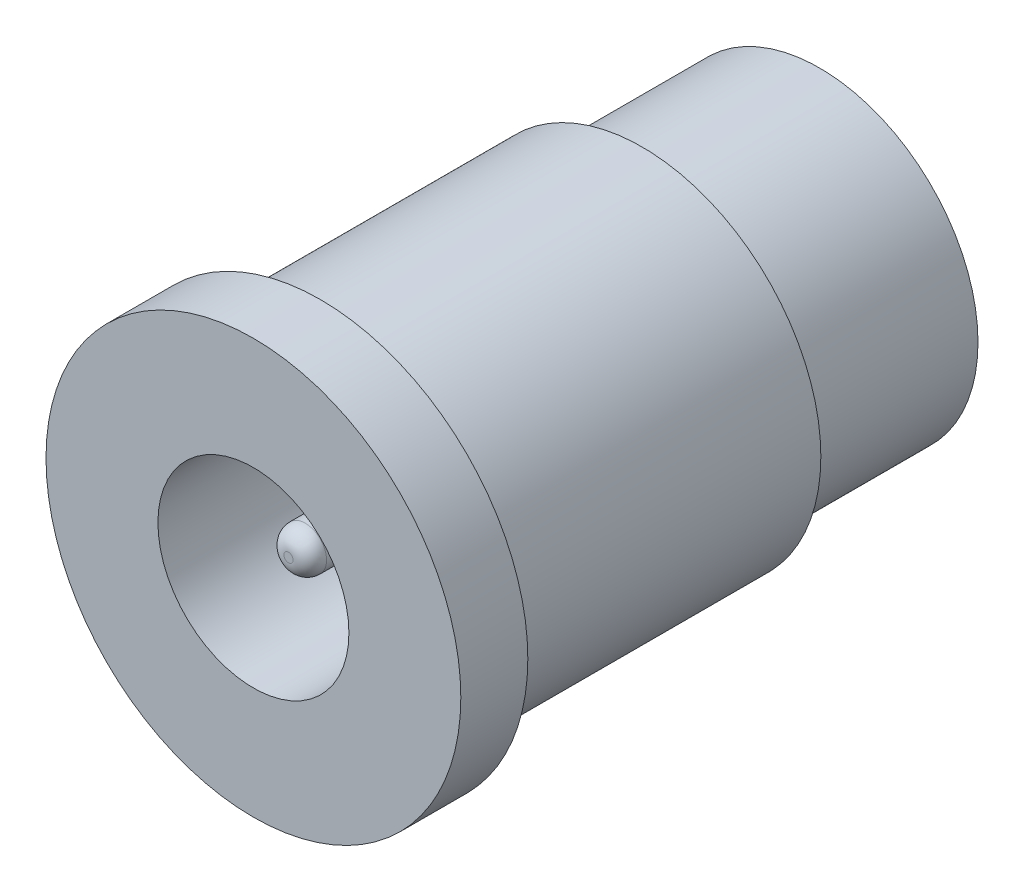
ISO-10303-21;
HEADER;
FILE_DESCRIPTION(('STEP AP214'),'2;1');
FILE_NAME('part.step','',(''),(''),'','','');
FILE_SCHEMA(('AUTOMOTIVE_DESIGN { 1 0 10303 214 1 1 1 1 }'));
ENDSEC;
DATA;
#1=APPLICATION_CONTEXT('core data for automotive mechanical design processes');
#2=APPLICATION_PROTOCOL_DEFINITION('international standard','automotive_design',2000,#1);
#3=PRODUCT_CONTEXT('',#1,'mechanical');
#4=PRODUCT('Part','Part','',(#3));
#5=PRODUCT_RELATED_PRODUCT_CATEGORY('part','',(#4));
#6=PRODUCT_DEFINITION_FORMATION('','',#4);
#7=PRODUCT_DEFINITION_CONTEXT('part definition',#1,'design');
#8=PRODUCT_DEFINITION('design','',#6,#7);
#9=PRODUCT_DEFINITION_SHAPE('','',#8);
#10=(LENGTH_UNIT() NAMED_UNIT(*) SI_UNIT(.MILLI.,.METRE.));
#11=(NAMED_UNIT(*) PLANE_ANGLE_UNIT() SI_UNIT($,.RADIAN.));
#12=(NAMED_UNIT(*) SI_UNIT($,.STERADIAN.) SOLID_ANGLE_UNIT());
#13=UNCERTAINTY_MEASURE_WITH_UNIT(LENGTH_MEASURE(1.E-05),#10,'distance_accuracy_value','');
#14=(GEOMETRIC_REPRESENTATION_CONTEXT(3) GLOBAL_UNCERTAINTY_ASSIGNED_CONTEXT((#13)) GLOBAL_UNIT_ASSIGNED_CONTEXT((#10,
#11,#12)) REPRESENTATION_CONTEXT('',''));
#15=CARTESIAN_POINT('',(0.,0.,0.));
#16=DIRECTION('',(0.,0.,1.));
#17=DIRECTION('',(1.,0.,0.));
#18=AXIS2_PLACEMENT_3D('',#15,#16,#17);
#19=CARTESIAN_POINT('',(0.,0.,5.00661764705883));
#20=DIRECTION('',(0.,0.,1.));
#21=DIRECTION('',(1.,0.,0.));
#22=AXIS2_PLACEMENT_3D('',#19,#20,#21);
#23=CYLINDRICAL_SURFACE('',#22,2.85);
#24=CARTESIAN_POINT('',(0.,0.,-11.6));
#25=DIRECTION('',(0.,0.,1.));
#26=DIRECTION('',(1.,0.,0.));
#27=AXIS2_PLACEMENT_3D('',#24,#25,#26);
#28=CIRCLE('',#27,2.85);
#29=CARTESIAN_POINT('',(2.85,0.,-11.6));
#30=VERTEX_POINT('',#29);
#31=EDGE_CURVE('E67',#30,#30,#28,.T.);
#32=ORIENTED_EDGE('',*,*,#31,.F.);
#33=EDGE_LOOP('',(#32));
#34=FACE_BOUND('',#33,.T.);
#35=CARTESIAN_POINT('',(0.,0.,0.));
#36=DIRECTION('',(0.,0.,1.));
#37=DIRECTION('',(1.,0.,0.));
#38=AXIS2_PLACEMENT_3D('',#35,#36,#37);
#39=CIRCLE('',#38,2.85);
#40=CARTESIAN_POINT('',(2.85,0.,0.));
#41=VERTEX_POINT('',#40);
#42=EDGE_CURVE('E10',#41,#41,#39,.T.);
#43=ORIENTED_EDGE('',*,*,#42,.T.);
#44=EDGE_LOOP('',(#43));
#45=FACE_BOUND('',#44,.T.);
#46=ADVANCED_FACE('F30',(#34,#45),#23,.F.);
#47=CARTESIAN_POINT('',(0.,2.85,0.));
#48=DIRECTION('',(0.,0.,-1.));
#49=DIRECTION('',(-1.,0.,0.));
#50=AXIS2_PLACEMENT_3D('',#47,#48,#49);
#51=PLANE('',#50);
#52=ORIENTED_EDGE('',*,*,#42,.F.);
#53=EDGE_LOOP('',(#52));
#54=FACE_BOUND('',#53,.T.);
#55=CARTESIAN_POINT('',(0.,0.,0.));
#56=DIRECTION('',(0.,0.,1.));
#57=DIRECTION('',(1.,0.,0.));
#58=AXIS2_PLACEMENT_3D('',#55,#56,#57);
#59=CIRCLE('',#58,6.19);
#60=CARTESIAN_POINT('',(6.19,0.,0.));
#61=VERTEX_POINT('',#60);
#62=EDGE_CURVE('E36',#61,#61,#59,.T.);
#63=ORIENTED_EDGE('',*,*,#62,.T.);
#64=EDGE_LOOP('',(#63));
#65=FACE_BOUND('',#64,.T.);
#66=ADVANCED_FACE('F74',(#54,#65),#51,.F.);
#67=CARTESIAN_POINT('',(0.,0.,5.00661764705883));
#68=DIRECTION('',(0.,0.,1.));
#69=DIRECTION('',(1.,0.,0.));
#70=AXIS2_PLACEMENT_3D('',#67,#68,#69);
#71=CYLINDRICAL_SURFACE('',#70,6.19);
#72=ORIENTED_EDGE('',*,*,#62,.F.);
#73=EDGE_LOOP('',(#72));
#74=FACE_BOUND('',#73,.T.);
#75=CARTESIAN_POINT('',(0.,0.,-2.));
#76=DIRECTION('',(0.,0.,1.));
#77=DIRECTION('',(1.,0.,0.));
#78=AXIS2_PLACEMENT_3D('',#75,#76,#77);
#79=CIRCLE('',#78,6.19);
#80=CARTESIAN_POINT('',(6.19,0.,-2.));
#81=VERTEX_POINT('',#80);
#82=EDGE_CURVE('E40',#81,#81,#79,.T.);
#83=ORIENTED_EDGE('',*,*,#82,.T.);
#84=EDGE_LOOP('',(#83));
#85=FACE_BOUND('',#84,.T.);
#86=ADVANCED_FACE('F78',(#74,#85),#71,.T.);
#87=CARTESIAN_POINT('',(0.,6.19,-2.));
#88=DIRECTION('',(0.,0.,1.));
#89=DIRECTION('',(1.,0.,0.));
#90=AXIS2_PLACEMENT_3D('',#87,#88,#89);
#91=PLANE('',#90);
#92=ORIENTED_EDGE('',*,*,#82,.F.);
#93=EDGE_LOOP('',(#92));
#94=FACE_BOUND('',#93,.T.);
#95=CARTESIAN_POINT('',(0.,0.,-2.));
#96=DIRECTION('',(0.,0.,1.));
#97=DIRECTION('',(1.,0.,0.));
#98=AXIS2_PLACEMENT_3D('',#95,#96,#97);
#99=CIRCLE('',#98,5.335);
#100=CARTESIAN_POINT('',(5.335,0.,-2.));
#101=VERTEX_POINT('',#100);
#102=EDGE_CURVE('E44',#101,#101,#99,.T.);
#103=ORIENTED_EDGE('',*,*,#102,.T.);
#104=EDGE_LOOP('',(#103));
#105=FACE_BOUND('',#104,.T.);
#106=ADVANCED_FACE('F83',(#94,#105),#91,.F.);
#107=CARTESIAN_POINT('',(0.,0.,5.00661764705883));
#108=DIRECTION('',(0.,0.,1.));
#109=DIRECTION('',(1.,0.,0.));
#110=AXIS2_PLACEMENT_3D('',#107,#108,#109);
#111=CYLINDRICAL_SURFACE('',#110,5.335);
#112=ORIENTED_EDGE('',*,*,#102,.F.);
#113=EDGE_LOOP('',(#112));
#114=FACE_BOUND('',#113,.T.);
#115=CARTESIAN_POINT('',(0.,0.,-11.6));
#116=DIRECTION('',(0.,0.,1.));
#117=DIRECTION('',(1.,0.,0.));
#118=AXIS2_PLACEMENT_3D('',#115,#116,#117);
#119=CIRCLE('',#118,5.335);
#120=CARTESIAN_POINT('',(5.335,0.,-11.6));
#121=VERTEX_POINT('',#120);
#122=EDGE_CURVE('E49',#121,#121,#119,.T.);
#123=ORIENTED_EDGE('',*,*,#122,.T.);
#124=EDGE_LOOP('',(#123));
#125=FACE_BOUND('',#124,.T.);
#126=ADVANCED_FACE('F89',(#114,#125),#111,.T.);
#127=CARTESIAN_POINT('',(0.,5.335,-11.6));
#128=DIRECTION('',(0.,0.,1.));
#129=DIRECTION('',(1.,0.,0.));
#130=AXIS2_PLACEMENT_3D('',#127,#128,#129);
#131=PLANE('',#130);
#132=ORIENTED_EDGE('',*,*,#122,.F.);
#133=EDGE_LOOP('',(#132));
#134=FACE_BOUND('',#133,.T.);
#135=CARTESIAN_POINT('',(0.,0.,-11.6));
#136=DIRECTION('',(0.,0.,1.));
#137=DIRECTION('',(1.,0.,0.));
#138=AXIS2_PLACEMENT_3D('',#135,#136,#137);
#139=CIRCLE('',#138,4.725);
#140=CARTESIAN_POINT('',(4.725,0.,-11.6));
#141=VERTEX_POINT('',#140);
#142=EDGE_CURVE('E52',#141,#141,#139,.T.);
#143=ORIENTED_EDGE('',*,*,#142,.T.);
#144=EDGE_LOOP('',(#143));
#145=FACE_BOUND('',#144,.T.);
#146=ADVANCED_FACE('F93',(#134,#145),#131,.F.);
#147=CARTESIAN_POINT('',(0.,0.,5.00661764705883));
#148=DIRECTION('',(0.,0.,1.));
#149=DIRECTION('',(1.,0.,0.));
#150=AXIS2_PLACEMENT_3D('',#147,#148,#149);
#151=CYLINDRICAL_SURFACE('',#150,4.725);
#152=ORIENTED_EDGE('',*,*,#142,.F.);
#153=EDGE_LOOP('',(#152));
#154=FACE_BOUND('',#153,.T.);
#155=CARTESIAN_POINT('',(0.,0.,-16.9));
#156=DIRECTION('',(0.,0.,1.));
#157=DIRECTION('',(1.,0.,0.));
#158=AXIS2_PLACEMENT_3D('',#155,#156,#157);
#159=CIRCLE('',#158,4.725);
#160=CARTESIAN_POINT('',(4.725,0.,-16.9));
#161=VERTEX_POINT('',#160);
#162=EDGE_CURVE('E55',#161,#161,#159,.T.);
#163=ORIENTED_EDGE('',*,*,#162,.T.);
#164=EDGE_LOOP('',(#163));
#165=FACE_BOUND('',#164,.T.);
#166=ADVANCED_FACE('F97',(#154,#165),#151,.T.);
#167=CARTESIAN_POINT('',(0.,4.725,-16.9));
#168=DIRECTION('',(0.,0.,1.));
#169=DIRECTION('',(1.,0.,0.));
#170=AXIS2_PLACEMENT_3D('',#167,#168,#169);
#171=PLANE('',#170);
#172=ORIENTED_EDGE('',*,*,#162,.F.);
#173=EDGE_LOOP('',(#172));
#174=FACE_BOUND('',#173,.T.);
#175=ADVANCED_FACE('F101',(#174),#171,.F.);
#176=CARTESIAN_POINT('',(0.,0.,-1.04683823529412));
#177=DIRECTION('',(0.,0.,-1.));
#178=DIRECTION('',(-1.,0.,0.));
#179=AXIS2_PLACEMENT_3D('',#176,#177,#178);
#180=PLANE('',#179);
#181=CARTESIAN_POINT('',(0.,0.,-1.04683823529412));
#182=DIRECTION('',(0.,0.,1.));
#183=DIRECTION('',(1.,0.,0.));
#184=AXIS2_PLACEMENT_3D('',#181,#182,#183);
#185=CIRCLE('',#184,0.137205882352938);
#186=CARTESIAN_POINT('',(0.137205882352938,0.,-1.04683823529412));
#187=VERTEX_POINT('',#186);
#188=EDGE_CURVE('E58',#187,#187,#185,.T.);
#189=ORIENTED_EDGE('',*,*,#188,.T.);
#190=EDGE_LOOP('',(#189));
#191=FACE_BOUND('',#190,.T.);
#192=ADVANCED_FACE('F105',(#191),#180,.F.);
#193=CARTESIAN_POINT('',(0.,0.,-1.54683823529412));
#194=DIRECTION('',(0.,0.,1.));
#195=DIRECTION('',(1.,0.,0.));
#196=AXIS2_PLACEMENT_3D('',#193,#194,#195);
#197=DEGENERATE_TOROIDAL_SURFACE('',#196,0.137205882352941,0.5,.T.);
#198=ORIENTED_EDGE('',*,*,#188,.F.);
#199=EDGE_LOOP('',(#198));
#200=FACE_BOUND('',#199,.T.);
#201=CARTESIAN_POINT('',(0.,0.,-1.54683823529412));
#202=DIRECTION('',(0.,0.,1.));
#203=DIRECTION('',(1.,0.,0.));
#204=AXIS2_PLACEMENT_3D('',#201,#202,#203);
#205=CIRCLE('',#204,0.637205882352941);
#206=CARTESIAN_POINT('',(0.637205882352941,0.,-1.54683823529412));
#207=VERTEX_POINT('',#206);
#208=EDGE_CURVE('E61',#207,#207,#205,.T.);
#209=ORIENTED_EDGE('',*,*,#208,.T.);
#210=EDGE_LOOP('',(#209));
#211=FACE_BOUND('',#210,.T.);
#212=ADVANCED_FACE('F109',(#200,#211),#197,.T.);
#213=CARTESIAN_POINT('',(0.,0.,5.00661764705883));
#214=DIRECTION('',(0.,0.,1.));
#215=DIRECTION('',(1.,0.,0.));
#216=AXIS2_PLACEMENT_3D('',#213,#214,#215);
#217=CYLINDRICAL_SURFACE('',#216,0.637205882352941);
#218=ORIENTED_EDGE('',*,*,#208,.F.);
#219=EDGE_LOOP('',(#218));
#220=FACE_BOUND('',#219,.T.);
#221=CARTESIAN_POINT('',(0.,0.,-11.6));
#222=DIRECTION('',(0.,0.,1.));
#223=DIRECTION('',(1.,0.,0.));
#224=AXIS2_PLACEMENT_3D('',#221,#222,#223);
#225=CIRCLE('',#224,0.637205882352941);
#226=CARTESIAN_POINT('',(0.637205882352941,0.,-11.6));
#227=VERTEX_POINT('',#226);
#228=EDGE_CURVE('E64',#227,#227,#225,.T.);
#229=ORIENTED_EDGE('',*,*,#228,.T.);
#230=EDGE_LOOP('',(#229));
#231=FACE_BOUND('',#230,.T.);
#232=ADVANCED_FACE('F113',(#220,#231),#217,.T.);
#233=CARTESIAN_POINT('',(0.,0.637205882352941,-11.6));
#234=DIRECTION('',(0.,0.,-1.));
#235=DIRECTION('',(-1.,0.,0.));
#236=AXIS2_PLACEMENT_3D('',#233,#234,#235);
#237=PLANE('',#236);
#238=ORIENTED_EDGE('',*,*,#228,.F.);
#239=EDGE_LOOP('',(#238));
#240=FACE_BOUND('',#239,.T.);
#241=ORIENTED_EDGE('',*,*,#31,.T.);
#242=EDGE_LOOP('',(#241));
#243=FACE_BOUND('',#242,.T.);
#244=ADVANCED_FACE('F71',(#240,#243),#237,.F.);
#245=CLOSED_SHELL('',(#46,#66,#86,#106,#126,#146,#166,#175,#192,#212,#232,#244));
#246=MANIFOLD_SOLID_BREP('B2',#245);
#247=ADVANCED_BREP_SHAPE_REPRESENTATION('',(#18,#246),#14);
#248=SHAPE_DEFINITION_REPRESENTATION(#9,#247);
ENDSEC;
END-ISO-10303-21;
